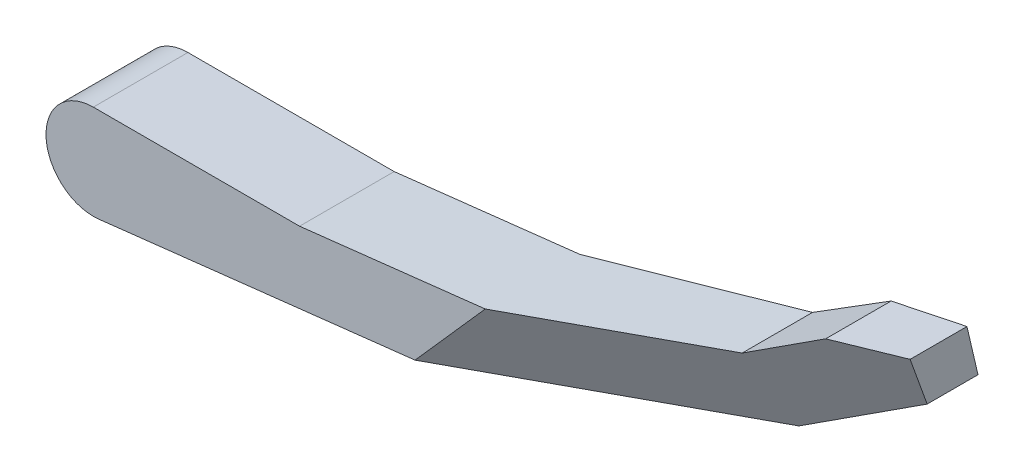
ISO-10303-21;
HEADER;
FILE_DESCRIPTION(('STEP AP214'),'2;1');
FILE_NAME('part.step','',(''),(''),'','','');
FILE_SCHEMA(('AUTOMOTIVE_DESIGN { 1 0 10303 214 1 1 1 1 }'));
ENDSEC;
DATA;
#1=APPLICATION_CONTEXT('core data for automotive mechanical design processes');
#2=APPLICATION_PROTOCOL_DEFINITION('international standard','automotive_design',2000,#1);
#3=PRODUCT_CONTEXT('',#1,'mechanical');
#4=PRODUCT('Part','Part','',(#3));
#5=PRODUCT_RELATED_PRODUCT_CATEGORY('part','',(#4));
#6=PRODUCT_DEFINITION_FORMATION('','',#4);
#7=PRODUCT_DEFINITION_CONTEXT('part definition',#1,'design');
#8=PRODUCT_DEFINITION('design','',#6,#7);
#9=PRODUCT_DEFINITION_SHAPE('','',#8);
#10=(LENGTH_UNIT() NAMED_UNIT(*) SI_UNIT(.MILLI.,.METRE.));
#11=(NAMED_UNIT(*) PLANE_ANGLE_UNIT() SI_UNIT($,.RADIAN.));
#12=(NAMED_UNIT(*) SI_UNIT($,.STERADIAN.) SOLID_ANGLE_UNIT());
#13=UNCERTAINTY_MEASURE_WITH_UNIT(LENGTH_MEASURE(1.E-05),#10,'distance_accuracy_value','');
#14=(GEOMETRIC_REPRESENTATION_CONTEXT(3) GLOBAL_UNCERTAINTY_ASSIGNED_CONTEXT((#13)) GLOBAL_UNIT_ASSIGNED_CONTEXT((#10,
#11,#12)) REPRESENTATION_CONTEXT('',''));
#15=CARTESIAN_POINT('',(0.,0.,0.));
#16=DIRECTION('',(0.,0.,1.));
#17=DIRECTION('',(1.,0.,0.));
#18=AXIS2_PLACEMENT_3D('',#15,#16,#17);
#19=CARTESIAN_POINT('',(0.,0.,-11.));
#20=DIRECTION('',(0.,0.,-1.));
#21=DIRECTION('',(-1.,0.,0.));
#22=AXIS2_PLACEMENT_3D('',#19,#20,#21);
#23=PLANE('',#22);
#24=DIRECTION('',(-0.993571855676588,-0.1132032137679,0.));
#25=VECTOR('',#24,1.);
#26=CARTESIAN_POINT('',(49.0397786357323,7.60031647523773,-11.));
#27=LINE('',#26,#25);
#28=CARTESIAN_POINT('',(33.1426806960217,5.78907095124608,-11.));
#29=VERTEX_POINT('',#28);
#30=CARTESIAN_POINT('',(17.4402064834858,4.,-11.));
#31=VERTEX_POINT('',#30);
#32=EDGE_CURVE('E161',#29,#31,#27,.T.);
#33=ORIENTED_EDGE('',*,*,#32,.F.);
#34=DIRECTION('',(-0.662620048215741,-0.748955720788999,0.));
#35=VECTOR('',#34,1.);
#36=CARTESIAN_POINT('',(15.7179186684471,-13.9060397522108,-11.));
#37=LINE('',#36,#35);
#38=CARTESIAN_POINT('',(27.2010599548502,-0.926709618390534,-11.));
#39=VERTEX_POINT('',#38);
#40=EDGE_CURVE('E134',#29,#39,#37,.T.);
#41=ORIENTED_EDGE('',*,*,#40,.T.);
#42=DIRECTION('',(0.993571855676588,0.1132032137679,0.));
#43=VECTOR('',#42,1.);
#44=CARTESIAN_POINT('',(0.452812855071593,-3.97428742270635,-11.));
#45=LINE('',#44,#43);
#46=CARTESIAN_POINT('',(0.452812855071593,-3.97428742270635,-11.));
#47=VERTEX_POINT('',#46);
#48=EDGE_CURVE('E165',#47,#39,#45,.T.);
#49=ORIENTED_EDGE('',*,*,#48,.F.);
#50=CARTESIAN_POINT('',(0.,0.,-11.));
#51=DIRECTION('',(0.,0.,1.));
#52=DIRECTION('',(-1.,0.,0.));
#53=AXIS2_PLACEMENT_3D('',#50,#51,#52);
#54=CIRCLE('',#53,4.);
#55=CARTESIAN_POINT('',(0.,4.,-11.));
#56=VERTEX_POINT('',#55);
#57=EDGE_CURVE('E139',#56,#47,#54,.T.);
#58=ORIENTED_EDGE('',*,*,#57,.F.);
#59=DIRECTION('',(-1.,0.,0.));
#60=VECTOR('',#59,1.);
#61=CARTESIAN_POINT('',(17.4402064834858,4.,-11.));
#62=LINE('',#61,#60);
#63=EDGE_CURVE('E157',#31,#56,#62,.T.);
#64=ORIENTED_EDGE('',*,*,#63,.F.);
#65=EDGE_LOOP('',(#33,#41,#49,#58,#64));
#66=FACE_BOUND('',#65,.T.);
#67=ADVANCED_FACE('F37',(#66),#23,.T.);
#68=CARTESIAN_POINT('',(0.,0.,-11.));
#69=DIRECTION('',(0.,0.,1.));
#70=DIRECTION('',(1.,0.,0.));
#71=AXIS2_PLACEMENT_3D('',#68,#69,#70);
#72=CYLINDRICAL_SURFACE('',#71,4.);
#73=CARTESIAN_POINT('',(0.,0.,-3.));
#74=DIRECTION('',(0.,0.,1.));
#75=DIRECTION('',(-1.,0.,0.));
#76=AXIS2_PLACEMENT_3D('',#73,#74,#75);
#77=CIRCLE('',#76,4.);
#78=CARTESIAN_POINT('',(0.,4.,-3.));
#79=VERTEX_POINT('',#78);
#80=CARTESIAN_POINT('',(0.452812855071593,-3.97428742270635,-3.));
#81=VERTEX_POINT('',#80);
#82=EDGE_CURVE('E129',#79,#81,#77,.T.);
#83=ORIENTED_EDGE('',*,*,#82,.F.);
#84=DIRECTION('',(0.,0.,1.));
#85=VECTOR('',#84,1.);
#86=CARTESIAN_POINT('',(0.,4.,-11.));
#87=LINE('',#86,#85);
#88=EDGE_CURVE('E45',#56,#79,#87,.T.);
#89=ORIENTED_EDGE('',*,*,#88,.F.);
#90=ORIENTED_EDGE('',*,*,#57,.T.);
#91=DIRECTION('',(0.,0.,1.));
#92=VECTOR('',#91,1.);
#93=CARTESIAN_POINT('',(0.452812855071593,-3.97428742270635,-11.));
#94=LINE('',#93,#92);
#95=EDGE_CURVE('E156',#47,#81,#94,.T.);
#96=ORIENTED_EDGE('',*,*,#95,.T.);
#97=EDGE_LOOP('',(#83,#89,#90,#96));
#98=FACE_BOUND('',#97,.T.);
#99=ADVANCED_FACE('F39',(#98),#72,.T.);
#100=CARTESIAN_POINT('',(17.4402064834858,4.,-11.));
#101=DIRECTION('',(0.,1.,0.));
#102=DIRECTION('',(-1.,0.,0.));
#103=AXIS2_PLACEMENT_3D('',#100,#101,#102);
#104=PLANE('',#103);
#105=DIRECTION('',(-1.,0.,0.));
#106=VECTOR('',#105,1.);
#107=CARTESIAN_POINT('',(17.4402064834858,4.,-3.));
#108=LINE('',#107,#106);
#109=CARTESIAN_POINT('',(17.4402064834858,4.,-3.));
#110=VERTEX_POINT('',#109);
#111=EDGE_CURVE('E132',#110,#79,#108,.T.);
#112=ORIENTED_EDGE('',*,*,#111,.F.);
#113=DIRECTION('',(0.,0.,1.));
#114=VECTOR('',#113,1.);
#115=CARTESIAN_POINT('',(17.4402064834858,4.,-11.));
#116=LINE('',#115,#114);
#117=EDGE_CURVE('E141',#31,#110,#116,.T.);
#118=ORIENTED_EDGE('',*,*,#117,.F.);
#119=ORIENTED_EDGE('',*,*,#63,.T.);
#120=ORIENTED_EDGE('',*,*,#88,.T.);
#121=EDGE_LOOP('',(#112,#118,#119,#120));
#122=FACE_BOUND('',#121,.T.);
#123=ADVANCED_FACE('F217',(#122),#104,.T.);
#124=CARTESIAN_POINT('',(49.0397786357323,7.60031647523773,-11.));
#125=DIRECTION('',(-0.1132032137679,0.993571855676588,0.));
#126=DIRECTION('',(-0.993571855676588,-0.1132032137679,0.));
#127=AXIS2_PLACEMENT_3D('',#124,#125,#126);
#128=PLANE('',#127);
#129=DIRECTION('',(-0.933652140999854,-0.106376224626946,0.342020143325663));
#130=VECTOR('',#129,1.);
#131=CARTESIAN_POINT('',(49.7347941477424,7.67950349037768,-9.07810636492084));
#132=LINE('',#131,#130);
#133=CARTESIAN_POINT('',(49.0397786357323,7.60031647523773,-8.82350479053072));
#134=VERTEX_POINT('',#133);
#135=CARTESIAN_POINT('',(33.1426806960217,5.78907095124608,-3.));
#136=VERTEX_POINT('',#135);
#137=EDGE_CURVE('E52',#134,#136,#132,.T.);
#138=ORIENTED_EDGE('',*,*,#137,.F.);
#139=DIRECTION('',(0.,0.,1.));
#140=VECTOR('',#139,1.);
#141=CARTESIAN_POINT('',(49.0397786357323,7.60031647523773,-11.));
#142=LINE('',#141,#140);
#143=CARTESIAN_POINT('',(49.0397786357323,7.60031647523773,-14.7715439060675));
#144=VERTEX_POINT('',#143);
#145=EDGE_CURVE('E144',#144,#134,#142,.T.);
#146=ORIENTED_EDGE('',*,*,#145,.F.);
#147=DIRECTION('',(0.967067511266677,0.110183425164921,-0.229434176772775));
#148=VECTOR('',#147,1.);
#149=CARTESIAN_POINT('',(48.202954740911,7.50497243573992,-14.5730096784409));
#150=LINE('',#149,#148);
#151=EDGE_CURVE('E181',#29,#144,#150,.T.);
#152=ORIENTED_EDGE('',*,*,#151,.F.);
#153=ORIENTED_EDGE('',*,*,#32,.T.);
#154=ORIENTED_EDGE('',*,*,#117,.T.);
#155=DIRECTION('',(-0.993571855676588,-0.1132032137679,0.));
#156=VECTOR('',#155,1.);
#157=CARTESIAN_POINT('',(49.0397786357323,7.60031647523773,-3.));
#158=LINE('',#157,#156);
#159=EDGE_CURVE('E130',#136,#110,#158,.T.);
#160=ORIENTED_EDGE('',*,*,#159,.F.);
#161=EDGE_LOOP('',(#138,#146,#152,#153,#154,#160));
#162=FACE_BOUND('',#161,.T.);
#163=ADVANCED_FACE('F214',(#162),#128,.T.);
#164=CARTESIAN_POINT('',(54.9282032302755,11.,-11.));
#165=DIRECTION('',(-0.499999999999995,0.866025403784441,0.));
#166=DIRECTION('',(-0.866025403784441,-0.499999999999995,0.));
#167=AXIS2_PLACEMENT_3D('',#164,#165,#166);
#168=PLANE('',#167);
#169=DIRECTION('',(-0.853407406135946,-0.492714995661003,0.17008154574525));
#170=VECTOR('',#169,1.);
#171=CARTESIAN_POINT('',(55.0737802389022,11.0840489251185,-10.0260632782092));
#172=LINE('',#171,#170);
#173=CARTESIAN_POINT('',(54.9282032302755,11.,-9.99705021542795));
#174=VERTEX_POINT('',#173);
#175=EDGE_CURVE('E173',#174,#134,#172,.T.);
#176=ORIENTED_EDGE('',*,*,#175,.F.);
#177=DIRECTION('',(0.,0.,1.));
#178=VECTOR('',#177,1.);
#179=CARTESIAN_POINT('',(54.9282032302755,11.,-11.));
#180=LINE('',#179,#178);
#181=CARTESIAN_POINT('',(54.9282032302755,11.,-15.5315807318226));
#182=VERTEX_POINT('',#181);
#183=EDGE_CURVE('E147',#182,#174,#180,.T.);
#184=ORIENTED_EDGE('',*,*,#183,.F.);
#185=DIRECTION('',(0.860665139374154,0.496905249899788,-0.111088660483856));
#186=VECTOR('',#185,1.);
#187=CARTESIAN_POINT('',(54.4949381736029,10.7498543028996,-15.4756578965893));
#188=LINE('',#187,#186);
#189=EDGE_CURVE('E183',#144,#182,#188,.T.);
#190=ORIENTED_EDGE('',*,*,#189,.F.);
#191=ORIENTED_EDGE('',*,*,#145,.T.);
#192=EDGE_LOOP('',(#176,#184,#190,#191));
#193=FACE_BOUND('',#192,.T.);
#194=ADVANCED_FACE('F209',(#193),#168,.T.);
#195=CARTESIAN_POINT('',(60.,11.,-11.));
#196=DIRECTION('',(0.,1.,0.));
#197=DIRECTION('',(-1.,0.,0.));
#198=AXIS2_PLACEMENT_3D('',#195,#196,#197);
#199=PLANE('',#198);
#200=DIRECTION('',(-0.926097764547837,0.,0.377283620767586));
#201=VECTOR('',#200,1.);
#202=CARTESIAN_POINT('',(59.6284977618995,11.,-11.9119065161891));
#203=LINE('',#202,#201);
#204=CARTESIAN_POINT('',(60.,11.,-12.0632530747052));
#205=VERTEX_POINT('',#204);
#206=EDGE_CURVE('E175',#205,#174,#203,.T.);
#207=ORIENTED_EDGE('',*,*,#206,.F.);
#208=DIRECTION('',(0.,0.,1.));
#209=VECTOR('',#208,1.);
#210=CARTESIAN_POINT('',(60.,11.,-11.));
#211=LINE('',#210,#209);
#212=CARTESIAN_POINT('',(60.,11.,-16.8697396383419));
#213=VERTEX_POINT('',#212);
#214=EDGE_CURVE('E150',#213,#205,#211,.T.);
#215=ORIENTED_EDGE('',*,*,#214,.F.);
#216=DIRECTION('',(0.966911264947976,0.,-0.255112927380611));
#217=VECTOR('',#216,1.);
#218=CARTESIAN_POINT('',(58.5521021471396,11.,-16.4877216877999));
#219=LINE('',#218,#217);
#220=EDGE_CURVE('E185',#182,#213,#219,.T.);
#221=ORIENTED_EDGE('',*,*,#220,.F.);
#222=ORIENTED_EDGE('',*,*,#183,.T.);
#223=EDGE_LOOP('',(#207,#215,#221,#222));
#224=FACE_BOUND('',#223,.T.);
#225=ADVANCED_FACE('F205',(#224),#199,.T.);
#226=CARTESIAN_POINT('',(60.,7.00000000000001,-11.));
#227=DIRECTION('',(1.,0.,0.));
#228=DIRECTION('',(0.,0.,-1.));
#229=AXIS2_PLACEMENT_3D('',#226,#227,#228);
#230=PLANE('',#229);
#231=DIRECTION('',(0.,0.940758767954674,0.339076599777106));
#232=VECTOR('',#231,1.);
#233=CARTESIAN_POINT('',(60.,7.79905809934093,-13.2169648791875));
#234=LINE('',#233,#232);
#235=CARTESIAN_POINT('',(60.,7.00000000000001,-13.5049684700953));
#236=VERTEX_POINT('',#235);
#237=EDGE_CURVE('E177',#236,#205,#234,.T.);
#238=ORIENTED_EDGE('',*,*,#237,.F.);
#239=DIRECTION('',(0.,0.,1.));
#240=VECTOR('',#239,1.);
#241=CARTESIAN_POINT('',(60.,7.00000000000001,-11.));
#242=LINE('',#241,#240);
#243=CARTESIAN_POINT('',(60.,7.00000000000001,-17.8034544903685));
#244=VERTEX_POINT('',#243);
#245=EDGE_CURVE('E153',#244,#236,#242,.T.);
#246=ORIENTED_EDGE('',*,*,#245,.F.);
#247=DIRECTION('',(0.,-0.973820652158255,-0.227317701532615));
#248=VECTOR('',#247,1.);
#249=CARTESIAN_POINT('',(60.,8.50605808104209,-17.4518972907976));
#250=LINE('',#249,#248);
#251=EDGE_CURVE('E187',#213,#244,#250,.T.);
#252=ORIENTED_EDGE('',*,*,#251,.F.);
#253=ORIENTED_EDGE('',*,*,#214,.T.);
#254=EDGE_LOOP('',(#238,#246,#252,#253));
#255=FACE_BOUND('',#254,.T.);
#256=ADVANCED_FACE('F201',(#255),#230,.T.);
#257=CARTESIAN_POINT('',(50.9589773774762,1.78016315513645,-11.));
#258=DIRECTION('',(0.499999999999994,-0.866025403784442,0.));
#259=DIRECTION('',(0.866025403784442,0.499999999999994,0.));
#260=AXIS2_PLACEMENT_3D('',#257,#258,#259);
#261=PLANE('',#260);
#262=DIRECTION('',(0.853407406135947,0.492714995661002,-0.170081545745251));
#263=VECTOR('',#262,1.);
#264=CARTESIAN_POINT('',(50.856920364053,1.72124051096392,-11.6827800215618));
#265=LINE('',#264,#263);
#266=CARTESIAN_POINT('',(50.9589773774762,1.78016315513645,-11.7031196793529));
#267=VERTEX_POINT('',#266);
#268=EDGE_CURVE('E179',#267,#236,#265,.T.);
#269=ORIENTED_EDGE('',*,*,#268,.F.);
#270=DIRECTION('',(0.,0.,1.));
#271=VECTOR('',#270,1.);
#272=CARTESIAN_POINT('',(50.9589773774762,1.78016315513645,-11.));
#273=LINE('',#272,#271);
#274=CARTESIAN_POINT('',(50.9589773774761,1.78016315513645,-16.6365022733068));
#275=VERTEX_POINT('',#274);
#276=EDGE_CURVE('E124',#275,#267,#273,.T.);
#277=ORIENTED_EDGE('',*,*,#276,.F.);
#278=DIRECTION('',(-0.860665139374154,-0.496905249899787,0.111088660483856));
#279=VECTOR('',#278,1.);
#280=CARTESIAN_POINT('',(50.4200706203417,1.46902519383677,-16.5669439433164));
#281=LINE('',#280,#279);
#282=EDGE_CURVE('E189',#244,#275,#281,.T.);
#283=ORIENTED_EDGE('',*,*,#282,.F.);
#284=ORIENTED_EDGE('',*,*,#245,.T.);
#285=EDGE_LOOP('',(#269,#277,#283,#284));
#286=FACE_BOUND('',#285,.T.);
#287=ADVANCED_FACE('F197',(#286),#261,.T.);
#288=CARTESIAN_POINT('',(0.452812855071593,-3.97428742270635,-11.));
#289=DIRECTION('',(0.1132032137679,-0.993571855676588,0.));
#290=DIRECTION('',(0.993571855676588,0.1132032137679,0.));
#291=AXIS2_PLACEMENT_3D('',#288,#289,#290);
#292=PLANE('',#291);
#293=DIRECTION('',(0.933652140999854,0.106376224626946,-0.342020143325663));
#294=VECTOR('',#293,1.);
#295=CARTESIAN_POINT('',(27.2010599548502,-0.926709618390531,-3.));
#296=LINE('',#295,#294);
#297=CARTESIAN_POINT('',(27.2010599548502,-0.926709618390531,-3.));
#298=VERTEX_POINT('',#297);
#299=EDGE_CURVE('E112',#298,#267,#296,.T.);
#300=ORIENTED_EDGE('',*,*,#299,.F.);
#301=DIRECTION('',(0.993571855676588,0.1132032137679,0.));
#302=VECTOR('',#301,1.);
#303=CARTESIAN_POINT('',(0.452812855071593,-3.97428742270635,-3.));
#304=LINE('',#303,#302);
#305=EDGE_CURVE('E121',#81,#298,#304,.T.);
#306=ORIENTED_EDGE('',*,*,#305,.F.);
#307=ORIENTED_EDGE('',*,*,#95,.F.);
#308=ORIENTED_EDGE('',*,*,#48,.T.);
#309=DIRECTION('',(-0.967067511266677,-0.110183425164921,0.229434176772776));
#310=VECTOR('',#309,1.);
#311=CARTESIAN_POINT('',(60.9211455975199,2.9152088512904,-19.));
#312=LINE('',#311,#310);
#313=EDGE_CURVE('E59',#275,#39,#312,.T.);
#314=ORIENTED_EDGE('',*,*,#313,.F.);
#315=ORIENTED_EDGE('',*,*,#276,.T.);
#316=EDGE_LOOP('',(#300,#306,#307,#308,#314,#315));
#317=FACE_BOUND('',#316,.T.);
#318=ADVANCED_FACE('F120',(#317),#292,.T.);
#319=CARTESIAN_POINT('',(0.,0.,-3.));
#320=DIRECTION('',(0.,0.,-1.));
#321=DIRECTION('',(-1.,0.,0.));
#322=AXIS2_PLACEMENT_3D('',#319,#320,#321);
#323=PLANE('',#322);
#324=ORIENTED_EDGE('',*,*,#305,.T.);
#325=DIRECTION('',(0.662620048215742,0.748955720788998,0.));
#326=VECTOR('',#325,1.);
#327=CARTESIAN_POINT('',(15.717918668447,-13.9060397522108,-3.));
#328=LINE('',#327,#326);
#329=EDGE_CURVE('E11',#298,#136,#328,.T.);
#330=ORIENTED_EDGE('',*,*,#329,.T.);
#331=ORIENTED_EDGE('',*,*,#159,.T.);
#332=ORIENTED_EDGE('',*,*,#111,.T.);
#333=ORIENTED_EDGE('',*,*,#82,.T.);
#334=EDGE_LOOP('',(#324,#330,#331,#332,#333));
#335=FACE_BOUND('',#334,.T.);
#336=ADVANCED_FACE('F126',(#335),#323,.F.);
#337=CARTESIAN_POINT('',(81.24092784299,25.8825446554381,-19.));
#338=DIRECTION('',(0.248853040522902,-0.220166572112178,0.943185477383362));
#339=DIRECTION('',(0.966911264947976,0.,-0.255112927380611));
#340=AXIS2_PLACEMENT_3D('',#337,#338,#339);
#341=PLANE('',#340);
#342=ORIENTED_EDGE('',*,*,#151,.T.);
#343=ORIENTED_EDGE('',*,*,#189,.T.);
#344=ORIENTED_EDGE('',*,*,#220,.T.);
#345=ORIENTED_EDGE('',*,*,#251,.T.);
#346=ORIENTED_EDGE('',*,*,#282,.T.);
#347=ORIENTED_EDGE('',*,*,#313,.T.);
#348=ORIENTED_EDGE('',*,*,#40,.F.);
#349=EDGE_LOOP('',(#342,#343,#344,#345,#346,#347,#348));
#350=FACE_BOUND('',#349,.T.);
#351=ADVANCED_FACE('F192',(#350),#341,.F.);
#352=CARTESIAN_POINT('',(47.5208422003202,22.0406261857572,-3.));
#353=DIRECTION('',(-0.357873358037031,0.31661960136684,-0.878452439029912));
#354=DIRECTION('',(-0.926097764547837,0.,0.377283620767586));
#355=AXIS2_PLACEMENT_3D('',#352,#353,#354);
#356=PLANE('',#355);
#357=ORIENTED_EDGE('',*,*,#137,.T.);
#358=ORIENTED_EDGE('',*,*,#329,.F.);
#359=ORIENTED_EDGE('',*,*,#299,.T.);
#360=ORIENTED_EDGE('',*,*,#268,.T.);
#361=ORIENTED_EDGE('',*,*,#237,.T.);
#362=ORIENTED_EDGE('',*,*,#206,.T.);
#363=ORIENTED_EDGE('',*,*,#175,.T.);
#364=EDGE_LOOP('',(#357,#358,#359,#360,#361,#362,#363));
#365=FACE_BOUND('',#364,.T.);
#366=ADVANCED_FACE('F111',(#365),#356,.F.);
#367=CLOSED_SHELL('',(#67,#99,#123,#163,#194,#225,#256,#287,#318,#336,#351,#366));
#368=MANIFOLD_SOLID_BREP('B2',#367);
#369=ADVANCED_BREP_SHAPE_REPRESENTATION('',(#18,#368),#14);
#370=SHAPE_DEFINITION_REPRESENTATION(#9,#369);
ENDSEC;
END-ISO-10303-21;
